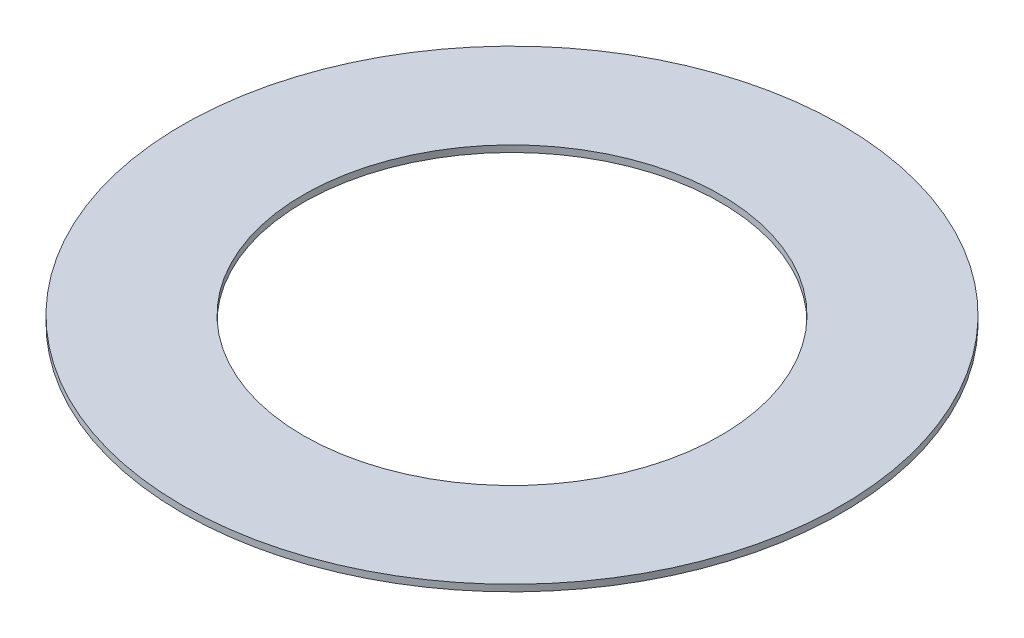
ISO-10303-21;
HEADER;
FILE_DESCRIPTION(('STEP AP214'),'2;1');
FILE_NAME('part.step','',(''),(''),'','','');
FILE_SCHEMA(('AUTOMOTIVE_DESIGN { 1 0 10303 214 1 1 1 1 }'));
ENDSEC;
DATA;
#1=APPLICATION_CONTEXT('core data for automotive mechanical design processes');
#2=APPLICATION_PROTOCOL_DEFINITION('international standard','automotive_design',2000,#1);
#3=PRODUCT_CONTEXT('',#1,'mechanical');
#4=PRODUCT('Part','Part','',(#3));
#5=PRODUCT_RELATED_PRODUCT_CATEGORY('part','',(#4));
#6=PRODUCT_DEFINITION_FORMATION('','',#4);
#7=PRODUCT_DEFINITION_CONTEXT('part definition',#1,'design');
#8=PRODUCT_DEFINITION('design','',#6,#7);
#9=PRODUCT_DEFINITION_SHAPE('','',#8);
#10=(LENGTH_UNIT() NAMED_UNIT(*) SI_UNIT(.MILLI.,.METRE.));
#11=(NAMED_UNIT(*) PLANE_ANGLE_UNIT() SI_UNIT($,.RADIAN.));
#12=(NAMED_UNIT(*) SI_UNIT($,.STERADIAN.) SOLID_ANGLE_UNIT());
#13=UNCERTAINTY_MEASURE_WITH_UNIT(LENGTH_MEASURE(1.E-05),#10,'distance_accuracy_value','');
#14=(GEOMETRIC_REPRESENTATION_CONTEXT(3) GLOBAL_UNCERTAINTY_ASSIGNED_CONTEXT((#13)) GLOBAL_UNIT_ASSIGNED_CONTEXT((#10,
#11,#12)) REPRESENTATION_CONTEXT('',''));
#15=CARTESIAN_POINT('',(0.,0.,0.));
#16=DIRECTION('',(0.,0.,1.));
#17=DIRECTION('',(1.,0.,0.));
#18=AXIS2_PLACEMENT_3D('',#15,#16,#17);
#19=CARTESIAN_POINT('',(0.,0.254,0.));
#20=DIRECTION('',(0.,1.,0.));
#21=DIRECTION('',(0.,0.,1.));
#22=AXIS2_PLACEMENT_3D('',#19,#20,#21);
#23=PLANE('',#22);
#24=CARTESIAN_POINT('',(0.,0.254,0.));
#25=DIRECTION('',(0.,1.,0.));
#26=DIRECTION('',(0.,0.,1.));
#27=AXIS2_PLACEMENT_3D('',#24,#25,#26);
#28=CIRCLE('',#27,12.7);
#29=CARTESIAN_POINT('',(0.,0.254,12.7));
#30=VERTEX_POINT('',#29);
#31=EDGE_CURVE('E27',#30,#30,#28,.F.);
#32=ORIENTED_EDGE('',*,*,#31,.F.);
#33=EDGE_LOOP('',(#32));
#34=FACE_BOUND('',#33,.T.);
#35=CARTESIAN_POINT('',(0.,0.254,0.));
#36=DIRECTION('',(0.,1.,0.));
#37=DIRECTION('',(0.,0.,1.));
#38=AXIS2_PLACEMENT_3D('',#35,#36,#37);
#39=CIRCLE('',#38,8.0391);
#40=CARTESIAN_POINT('',(0.,0.254,8.0391));
#41=VERTEX_POINT('',#40);
#42=EDGE_CURVE('E18',#41,#41,#39,.F.);
#43=ORIENTED_EDGE('',*,*,#42,.T.);
#44=EDGE_LOOP('',(#43));
#45=FACE_BOUND('',#44,.T.);
#46=ADVANCED_FACE('F15',(#34,#45),#23,.T.);
#47=CARTESIAN_POINT('',(0.,0.254,0.));
#48=DIRECTION('',(0.,1.,0.));
#49=DIRECTION('',(0.,0.,1.));
#50=AXIS2_PLACEMENT_3D('',#47,#48,#49);
#51=CYLINDRICAL_SURFACE('',#50,8.0391);
#52=CARTESIAN_POINT('',(0.,0.,0.));
#53=DIRECTION('',(0.,1.,0.));
#54=DIRECTION('',(0.,0.,1.));
#55=AXIS2_PLACEMENT_3D('',#52,#53,#54);
#56=CIRCLE('',#55,8.0391);
#57=CARTESIAN_POINT('',(0.,0.,8.0391));
#58=VERTEX_POINT('',#57);
#59=EDGE_CURVE('E22',#58,#58,#56,.F.);
#60=ORIENTED_EDGE('',*,*,#59,.T.);
#61=EDGE_LOOP('',(#60));
#62=FACE_BOUND('',#61,.T.);
#63=ORIENTED_EDGE('',*,*,#42,.F.);
#64=EDGE_LOOP('',(#63));
#65=FACE_BOUND('',#64,.T.);
#66=ADVANCED_FACE('F36',(#62,#65),#51,.F.);
#67=CARTESIAN_POINT('',(0.,0.254,0.));
#68=DIRECTION('',(0.,1.,0.));
#69=DIRECTION('',(0.,0.,1.));
#70=AXIS2_PLACEMENT_3D('',#67,#68,#69);
#71=CYLINDRICAL_SURFACE('',#70,12.7);
#72=CARTESIAN_POINT('',(0.,0.,0.));
#73=DIRECTION('',(0.,1.,0.));
#74=DIRECTION('',(0.,0.,1.));
#75=AXIS2_PLACEMENT_3D('',#72,#73,#74);
#76=CIRCLE('',#75,12.7);
#77=CARTESIAN_POINT('',(0.,0.,12.7));
#78=VERTEX_POINT('',#77);
#79=EDGE_CURVE('E10',#78,#78,#76,.T.);
#80=ORIENTED_EDGE('',*,*,#79,.T.);
#81=EDGE_LOOP('',(#80));
#82=FACE_BOUND('',#81,.T.);
#83=ORIENTED_EDGE('',*,*,#31,.T.);
#84=EDGE_LOOP('',(#83));
#85=FACE_BOUND('',#84,.T.);
#86=ADVANCED_FACE('F38',(#82,#85),#71,.T.);
#87=CARTESIAN_POINT('',(0.,0.,0.));
#88=DIRECTION('',(0.,1.,0.));
#89=DIRECTION('',(0.,0.,1.));
#90=AXIS2_PLACEMENT_3D('',#87,#88,#89);
#91=PLANE('',#90);
#92=ORIENTED_EDGE('',*,*,#79,.F.);
#93=EDGE_LOOP('',(#92));
#94=FACE_BOUND('',#93,.T.);
#95=ORIENTED_EDGE('',*,*,#59,.F.);
#96=EDGE_LOOP('',(#95));
#97=FACE_BOUND('',#96,.T.);
#98=ADVANCED_FACE('F45',(#94,#97),#91,.F.);
#99=CLOSED_SHELL('',(#46,#66,#86,#98));
#100=MANIFOLD_SOLID_BREP('B1',#99);
#101=ADVANCED_BREP_SHAPE_REPRESENTATION('',(#18,#100),#14);
#102=SHAPE_DEFINITION_REPRESENTATION(#9,#101);
ENDSEC;
END-ISO-10303-21;
